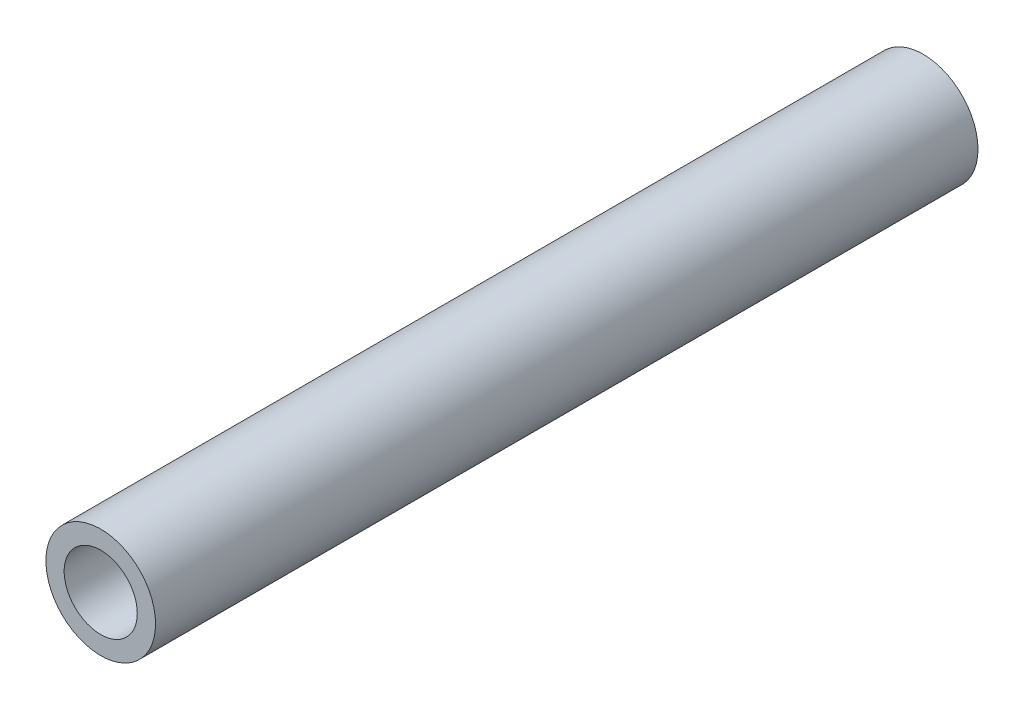
ISO-10303-21;
HEADER;
FILE_DESCRIPTION(('STEP AP214'),'2;1');
FILE_NAME('part.step','',(''),(''),'','','');
FILE_SCHEMA(('AUTOMOTIVE_DESIGN { 1 0 10303 214 1 1 1 1 }'));
ENDSEC;
DATA;
#1=APPLICATION_CONTEXT('core data for automotive mechanical design processes');
#2=APPLICATION_PROTOCOL_DEFINITION('international standard','automotive_design',2000,#1);
#3=PRODUCT_CONTEXT('',#1,'mechanical');
#4=PRODUCT('Part','Part','',(#3));
#5=PRODUCT_RELATED_PRODUCT_CATEGORY('part','',(#4));
#6=PRODUCT_DEFINITION_FORMATION('','',#4);
#7=PRODUCT_DEFINITION_CONTEXT('part definition',#1,'design');
#8=PRODUCT_DEFINITION('design','',#6,#7);
#9=PRODUCT_DEFINITION_SHAPE('','',#8);
#10=(LENGTH_UNIT() NAMED_UNIT(*) SI_UNIT(.MILLI.,.METRE.));
#11=(NAMED_UNIT(*) PLANE_ANGLE_UNIT() SI_UNIT($,.RADIAN.));
#12=(NAMED_UNIT(*) SI_UNIT($,.STERADIAN.) SOLID_ANGLE_UNIT());
#13=UNCERTAINTY_MEASURE_WITH_UNIT(LENGTH_MEASURE(1.E-05),#10,'distance_accuracy_value','');
#14=(GEOMETRIC_REPRESENTATION_CONTEXT(3) GLOBAL_UNCERTAINTY_ASSIGNED_CONTEXT((#13)) GLOBAL_UNIT_ASSIGNED_CONTEXT((#10,
#11,#12)) REPRESENTATION_CONTEXT('',''));
#15=CARTESIAN_POINT('',(0.,0.,0.));
#16=DIRECTION('',(0.,0.,1.));
#17=DIRECTION('',(1.,0.,0.));
#18=AXIS2_PLACEMENT_3D('',#15,#16,#17);
#19=CARTESIAN_POINT('',(0.,0.,22.5));
#20=DIRECTION('',(0.,0.,1.));
#21=DIRECTION('',(1.,0.,0.));
#22=AXIS2_PLACEMENT_3D('',#19,#20,#21);
#23=PLANE('',#22);
#24=CARTESIAN_POINT('',(0.,0.,22.5));
#25=DIRECTION('',(0.,0.,1.));
#26=DIRECTION('',(1.,0.,0.));
#27=AXIS2_PLACEMENT_3D('',#24,#25,#26);
#28=CIRCLE('',#27,3.);
#29=CARTESIAN_POINT('',(3.,0.,22.5));
#30=VERTEX_POINT('',#29);
#31=EDGE_CURVE('E10',#30,#30,#28,.T.);
#32=ORIENTED_EDGE('',*,*,#31,.T.);
#33=EDGE_LOOP('',(#32));
#34=FACE_BOUND('',#33,.T.);
#35=CARTESIAN_POINT('',(0.,0.,22.5));
#36=DIRECTION('',(0.,0.,1.));
#37=DIRECTION('',(1.,0.,0.));
#38=AXIS2_PLACEMENT_3D('',#35,#36,#37);
#39=CIRCLE('',#38,2.);
#40=CARTESIAN_POINT('',(2.,0.,22.5));
#41=VERTEX_POINT('',#40);
#42=EDGE_CURVE('E41',#41,#41,#39,.T.);
#43=ORIENTED_EDGE('',*,*,#42,.F.);
#44=EDGE_LOOP('',(#43));
#45=FACE_BOUND('',#44,.T.);
#46=ADVANCED_FACE('F30',(#34,#45),#23,.T.);
#47=CARTESIAN_POINT('',(0.,0.,-22.5));
#48=DIRECTION('',(0.,0.,1.));
#49=DIRECTION('',(1.,0.,0.));
#50=AXIS2_PLACEMENT_3D('',#47,#48,#49);
#51=PLANE('',#50);
#52=CARTESIAN_POINT('',(0.,0.,-22.5));
#53=DIRECTION('',(0.,0.,1.));
#54=DIRECTION('',(1.,0.,0.));
#55=AXIS2_PLACEMENT_3D('',#52,#53,#54);
#56=CIRCLE('',#55,3.);
#57=CARTESIAN_POINT('',(3.,0.,-22.5));
#58=VERTEX_POINT('',#57);
#59=EDGE_CURVE('E34',#58,#58,#56,.T.);
#60=ORIENTED_EDGE('',*,*,#59,.F.);
#61=EDGE_LOOP('',(#60));
#62=FACE_BOUND('',#61,.T.);
#63=CARTESIAN_POINT('',(0.,0.,-22.5));
#64=DIRECTION('',(0.,0.,1.));
#65=DIRECTION('',(1.,0.,0.));
#66=AXIS2_PLACEMENT_3D('',#63,#64,#65);
#67=CIRCLE('',#66,2.);
#68=CARTESIAN_POINT('',(2.,0.,-22.5));
#69=VERTEX_POINT('',#68);
#70=EDGE_CURVE('E43',#69,#69,#67,.T.);
#71=ORIENTED_EDGE('',*,*,#70,.T.);
#72=EDGE_LOOP('',(#71));
#73=FACE_BOUND('',#72,.T.);
#74=ADVANCED_FACE('F53',(#62,#73),#51,.F.);
#75=CARTESIAN_POINT('',(0.,0.,22.5));
#76=DIRECTION('',(0.,0.,-1.));
#77=DIRECTION('',(-1.,0.,0.));
#78=AXIS2_PLACEMENT_3D('',#75,#76,#77);
#79=CYLINDRICAL_SURFACE('',#78,3.);
#80=ORIENTED_EDGE('',*,*,#31,.F.);
#81=EDGE_LOOP('',(#80));
#82=FACE_BOUND('',#81,.T.);
#83=ORIENTED_EDGE('',*,*,#59,.T.);
#84=EDGE_LOOP('',(#83));
#85=FACE_BOUND('',#84,.T.);
#86=ADVANCED_FACE('F32',(#82,#85),#79,.T.);
#87=CARTESIAN_POINT('',(0.,0.,22.5));
#88=DIRECTION('',(0.,0.,-1.));
#89=DIRECTION('',(-1.,0.,0.));
#90=AXIS2_PLACEMENT_3D('',#87,#88,#89);
#91=CYLINDRICAL_SURFACE('',#90,2.);
#92=ORIENTED_EDGE('',*,*,#42,.T.);
#93=EDGE_LOOP('',(#92));
#94=FACE_BOUND('',#93,.T.);
#95=ORIENTED_EDGE('',*,*,#70,.F.);
#96=EDGE_LOOP('',(#95));
#97=FACE_BOUND('',#96,.T.);
#98=ADVANCED_FACE('F49',(#94,#97),#91,.F.);
#99=CLOSED_SHELL('',(#46,#74,#86,#98));
#100=MANIFOLD_SOLID_BREP('B2',#99);
#101=ADVANCED_BREP_SHAPE_REPRESENTATION('',(#18,#100),#14);
#102=SHAPE_DEFINITION_REPRESENTATION(#9,#101);
ENDSEC;
END-ISO-10303-21;
